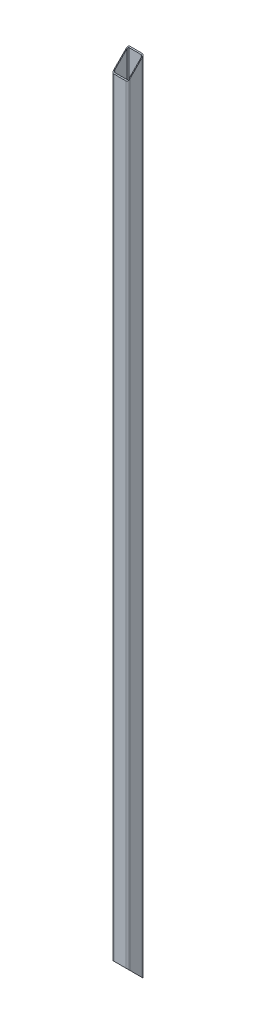
ISO-10303-21;
HEADER;
FILE_DESCRIPTION(('STEP AP214'),'2;1');
FILE_NAME('part.step','',(''),(''),'','','');
FILE_SCHEMA(('AUTOMOTIVE_DESIGN { 1 0 10303 214 1 1 1 1 }'));
ENDSEC;
DATA;
#1=APPLICATION_CONTEXT('core data for automotive mechanical design processes');
#2=APPLICATION_PROTOCOL_DEFINITION('international standard','automotive_design',2000,#1);
#3=PRODUCT_CONTEXT('',#1,'mechanical');
#4=PRODUCT('Part','Part','',(#3));
#5=PRODUCT_RELATED_PRODUCT_CATEGORY('part','',(#4));
#6=PRODUCT_DEFINITION_FORMATION('','',#4);
#7=PRODUCT_DEFINITION_CONTEXT('part definition',#1,'design');
#8=PRODUCT_DEFINITION('design','',#6,#7);
#9=PRODUCT_DEFINITION_SHAPE('','',#8);
#10=(LENGTH_UNIT() NAMED_UNIT(*) SI_UNIT(.MILLI.,.METRE.));
#11=(NAMED_UNIT(*) PLANE_ANGLE_UNIT() SI_UNIT($,.RADIAN.));
#12=(NAMED_UNIT(*) SI_UNIT($,.STERADIAN.) SOLID_ANGLE_UNIT());
#13=UNCERTAINTY_MEASURE_WITH_UNIT(LENGTH_MEASURE(1.E-05),#10,'distance_accuracy_value','');
#14=(GEOMETRIC_REPRESENTATION_CONTEXT(3) GLOBAL_UNCERTAINTY_ASSIGNED_CONTEXT((#13)) GLOBAL_UNIT_ASSIGNED_CONTEXT((#10,
#11,#12)) REPRESENTATION_CONTEXT('',''));
#15=CARTESIAN_POINT('',(0.,0.,0.));
#16=DIRECTION('',(0.,0.,1.));
#17=DIRECTION('',(1.,0.,0.));
#18=AXIS2_PLACEMENT_3D('',#15,#16,#17);
#19=CARTESIAN_POINT('',(-15.5,1960.,-3220.));
#20=DIRECTION('',(0.,0.,-1.));
#21=DIRECTION('',(-1.,0.,0.));
#22=AXIS2_PLACEMENT_3D('',#19,#20,#21);
#23=PLANE('',#22);
#24=DIRECTION('',(0.,-1.,0.));
#25=VECTOR('',#24,1.);
#26=CARTESIAN_POINT('',(-15.5,1960.,-3220.));
#27=LINE('',#26,#25);
#28=CARTESIAN_POINT('',(-15.5,1940.,-3220.));
#29=VERTEX_POINT('',#28);
#30=CARTESIAN_POINT('',(-15.5,20.0000000000002,-3220.));
#31=VERTEX_POINT('',#30);
#32=EDGE_CURVE('E209',#29,#31,#27,.T.);
#33=ORIENTED_EDGE('',*,*,#32,.T.);
#34=DIRECTION('',(-1.,0.,0.));
#35=VECTOR('',#34,1.);
#36=CARTESIAN_POINT('',(-15.5,20.0000000000002,-3220.));
#37=LINE('',#36,#35);
#38=CARTESIAN_POINT('',(15.5,20.0000000000002,-3220.));
#39=VERTEX_POINT('',#38);
#40=EDGE_CURVE('E239',#39,#31,#37,.T.);
#41=ORIENTED_EDGE('',*,*,#40,.F.);
#42=DIRECTION('',(0.,-1.,0.));
#43=VECTOR('',#42,1.);
#44=CARTESIAN_POINT('',(15.5,1960.,-3220.));
#45=LINE('',#44,#43);
#46=CARTESIAN_POINT('',(15.5,1940.,-3220.));
#47=VERTEX_POINT('',#46);
#48=EDGE_CURVE('E207',#47,#39,#45,.T.);
#49=ORIENTED_EDGE('',*,*,#48,.F.);
#50=DIRECTION('',(1.,0.,0.));
#51=VECTOR('',#50,1.);
#52=CARTESIAN_POINT('',(-15.5,1940.,-3220.));
#53=LINE('',#52,#51);
#54=EDGE_CURVE('E279',#29,#47,#53,.T.);
#55=ORIENTED_EDGE('',*,*,#54,.F.);
#56=EDGE_LOOP('',(#33,#41,#49,#55));
#57=FACE_BOUND('',#56,.T.);
#58=ADVANCED_FACE('F39',(#57),#23,.F.);
#59=CARTESIAN_POINT('',(0.,0.,-3240.));
#60=DIRECTION('',(0.,-0.707106781186548,0.707106781186547));
#61=DIRECTION('',(0.,-0.707106781186547,-0.707106781186548));
#62=AXIS2_PLACEMENT_3D('',#59,#60,#61);
#63=PLANE('',#62);
#64=DIRECTION('',(0.,-0.707106781186547,-0.707106781186548));
#65=VECTOR('',#64,1.);
#66=CARTESIAN_POINT('',(-18.,972.5,-2267.5));
#67=LINE('',#66,#65);
#68=CARTESIAN_POINT('',(-18.,15.0000000000003,-3225.));
#69=VERTEX_POINT('',#68);
#70=CARTESIAN_POINT('',(-18.,-15.0000000000001,-3255.));
#71=VERTEX_POINT('',#70);
#72=EDGE_CURVE('E152',#69,#71,#67,.T.);
#73=ORIENTED_EDGE('',*,*,#72,.F.);
#74=CARTESIAN_POINT('',(-15.,15.0000000000003,-3225.));
#75=DIRECTION('',(0.,-0.707106781186548,0.707106781186547));
#76=DIRECTION('',(0.,-0.707106781186547,-0.707106781186548));
#77=AXIS2_PLACEMENT_3D('',#74,#75,#76);
#78=ELLIPSE('',#77,4.24264068711928,3.);
#79=CARTESIAN_POINT('',(-15.,17.9999999999998,-3222.));
#80=VERTEX_POINT('',#79);
#81=EDGE_CURVE('E166',#80,#69,#78,.T.);
#82=ORIENTED_EDGE('',*,*,#81,.F.);
#83=DIRECTION('',(-1.,0.,0.));
#84=VECTOR('',#83,1.);
#85=CARTESIAN_POINT('',(-15.,17.9999999999998,-3222.));
#86=LINE('',#85,#84);
#87=CARTESIAN_POINT('',(15.,18.0000000000002,-3222.));
#88=VERTEX_POINT('',#87);
#89=EDGE_CURVE('E225',#88,#80,#86,.T.);
#90=ORIENTED_EDGE('',*,*,#89,.F.);
#91=CARTESIAN_POINT('',(15.,15.0000000000003,-3225.));
#92=DIRECTION('',(0.,-0.707106781186548,0.707106781186547));
#93=DIRECTION('',(0.,-0.707106781186547,-0.707106781186548));
#94=AXIS2_PLACEMENT_3D('',#91,#92,#93);
#95=ELLIPSE('',#94,4.24264068711928,3.);
#96=CARTESIAN_POINT('',(18.,15.0000000000001,-3225.));
#97=VERTEX_POINT('',#96);
#98=EDGE_CURVE('E227',#97,#88,#95,.T.);
#99=ORIENTED_EDGE('',*,*,#98,.F.);
#100=DIRECTION('',(0.,0.707106781186547,0.707106781186548));
#101=VECTOR('',#100,1.);
#102=CARTESIAN_POINT('',(18.,972.5,-2267.5));
#103=LINE('',#102,#101);
#104=CARTESIAN_POINT('',(18.,-15.0000000000001,-3255.));
#105=VERTEX_POINT('',#104);
#106=EDGE_CURVE('E456',#105,#97,#103,.T.);
#107=ORIENTED_EDGE('',*,*,#106,.F.);
#108=CARTESIAN_POINT('',(15.,-15.0000000000001,-3255.));
#109=DIRECTION('',(0.,-0.707106781186548,0.707106781186547));
#110=DIRECTION('',(0.,-0.707106781186547,-0.707106781186548));
#111=AXIS2_PLACEMENT_3D('',#108,#109,#110);
#112=ELLIPSE('',#111,4.24264068711928,3.);
#113=CARTESIAN_POINT('',(15.,-17.9999999999996,-3258.));
#114=VERTEX_POINT('',#113);
#115=EDGE_CURVE('E457',#114,#105,#112,.T.);
#116=ORIENTED_EDGE('',*,*,#115,.F.);
#117=DIRECTION('',(1.,0.,0.));
#118=VECTOR('',#117,1.);
#119=CARTESIAN_POINT('',(-15.,-17.9999999999996,-3258.));
#120=LINE('',#119,#118);
#121=CARTESIAN_POINT('',(-15.,-17.9999999999998,-3258.));
#122=VERTEX_POINT('',#121);
#123=EDGE_CURVE('E62',#122,#114,#120,.T.);
#124=ORIENTED_EDGE('',*,*,#123,.F.);
#125=CARTESIAN_POINT('',(-15.,-15.0000000000001,-3255.));
#126=DIRECTION('',(0.,-0.707106781186548,0.707106781186547));
#127=DIRECTION('',(0.,-0.707106781186547,-0.707106781186548));
#128=AXIS2_PLACEMENT_3D('',#125,#126,#127);
#129=ELLIPSE('',#128,4.24264068711928,3.);
#130=EDGE_CURVE('E11',#71,#122,#129,.T.);
#131=ORIENTED_EDGE('',*,*,#130,.F.);
#132=EDGE_LOOP('',(#73,#82,#90,#99,#107,#116,#124,#131));
#133=FACE_BOUND('',#132,.T.);
#134=CARTESIAN_POINT('',(-15.5,-15.4999999999996,-3255.5));
#135=DIRECTION('',(0.,-0.707106781186548,0.707106781186547));
#136=DIRECTION('',(0.,-0.707106781186547,-0.707106781186548));
#137=AXIS2_PLACEMENT_3D('',#134,#135,#136);
#138=ELLIPSE('',#137,6.36396103067893,4.5);
#139=CARTESIAN_POINT('',(-20.,-15.4999999999996,-3255.5));
#140=VERTEX_POINT('',#139);
#141=CARTESIAN_POINT('',(-15.5,-20.,-3260.));
#142=VERTEX_POINT('',#141);
#143=EDGE_CURVE('E165',#140,#142,#138,.T.);
#144=ORIENTED_EDGE('',*,*,#143,.T.);
#145=DIRECTION('',(1.,0.,0.));
#146=VECTOR('',#145,1.);
#147=CARTESIAN_POINT('',(-15.5,-20.,-3260.));
#148=LINE('',#147,#146);
#149=CARTESIAN_POINT('',(15.5,-20.,-3260.));
#150=VERTEX_POINT('',#149);
#151=EDGE_CURVE('E221',#142,#150,#148,.T.);
#152=ORIENTED_EDGE('',*,*,#151,.T.);
#153=CARTESIAN_POINT('',(15.5,-15.4999999999996,-3255.5));
#154=DIRECTION('',(0.,-0.707106781186548,0.707106781186547));
#155=DIRECTION('',(0.,-0.707106781186547,-0.707106781186548));
#156=AXIS2_PLACEMENT_3D('',#153,#154,#155);
#157=ELLIPSE('',#156,6.36396103067893,4.5);
#158=CARTESIAN_POINT('',(20.,-15.4999999999992,-3255.5));
#159=VERTEX_POINT('',#158);
#160=EDGE_CURVE('E248',#150,#159,#157,.T.);
#161=ORIENTED_EDGE('',*,*,#160,.T.);
#162=DIRECTION('',(0.,0.707106781186547,0.707106781186548));
#163=VECTOR('',#162,1.);
#164=CARTESIAN_POINT('',(20.,972.25,-2267.75));
#165=LINE('',#164,#163);
#166=CARTESIAN_POINT('',(20.,15.4999999999998,-3224.5));
#167=VERTEX_POINT('',#166);
#168=EDGE_CURVE('E245',#159,#167,#165,.T.);
#169=ORIENTED_EDGE('',*,*,#168,.T.);
#170=CARTESIAN_POINT('',(15.5,15.4999999999998,-3224.5));
#171=DIRECTION('',(0.,-0.707106781186548,0.707106781186547));
#172=DIRECTION('',(0.,-0.707106781186547,-0.707106781186548));
#173=AXIS2_PLACEMENT_3D('',#170,#171,#172);
#174=ELLIPSE('',#173,6.36396103067893,4.5);
#175=EDGE_CURVE('E242',#167,#39,#174,.T.);
#176=ORIENTED_EDGE('',*,*,#175,.T.);
#177=ORIENTED_EDGE('',*,*,#40,.T.);
#178=CARTESIAN_POINT('',(-15.5,15.4999999999998,-3224.5));
#179=DIRECTION('',(0.,-0.707106781186548,0.707106781186547));
#180=DIRECTION('',(0.,-0.707106781186547,-0.707106781186548));
#181=AXIS2_PLACEMENT_3D('',#178,#179,#180);
#182=ELLIPSE('',#181,6.36396103067893,4.5);
#183=CARTESIAN_POINT('',(-20.,15.5000000000005,-3224.5));
#184=VERTEX_POINT('',#183);
#185=EDGE_CURVE('E236',#31,#184,#182,.T.);
#186=ORIENTED_EDGE('',*,*,#185,.T.);
#187=DIRECTION('',(0.,-0.707106781186547,-0.707106781186548));
#188=VECTOR('',#187,1.);
#189=CARTESIAN_POINT('',(-20.,972.25,-2267.75));
#190=LINE('',#189,#188);
#191=EDGE_CURVE('E233',#184,#140,#190,.T.);
#192=ORIENTED_EDGE('',*,*,#191,.T.);
#193=EDGE_LOOP('',(#144,#152,#161,#169,#176,#177,#186,#192));
#194=FACE_BOUND('',#193,.T.);
#195=ADVANCED_FACE('F150',(#133,#194),#63,.T.);
#196=CARTESIAN_POINT('',(15.5,1960.,-3255.5));
#197=DIRECTION('',(0.,-1.,0.));
#198=DIRECTION('',(0.,0.,-1.));
#199=AXIS2_PLACEMENT_3D('',#196,#197,#198);
#200=CYLINDRICAL_SURFACE('',#199,4.5);
#201=ORIENTED_EDGE('',*,*,#160,.F.);
#202=DIRECTION('',(0.,-1.,0.));
#203=VECTOR('',#202,1.);
#204=CARTESIAN_POINT('',(15.5,1960.,-3260.));
#205=LINE('',#204,#203);
#206=CARTESIAN_POINT('',(15.5,1980.,-3260.));
#207=VERTEX_POINT('',#206);
#208=EDGE_CURVE('E198',#207,#150,#205,.T.);
#209=ORIENTED_EDGE('',*,*,#208,.F.);
#210=CARTESIAN_POINT('',(15.5,1975.5,-3255.5));
#211=DIRECTION('',(0.,0.707106781186548,0.707106781186547));
#212=DIRECTION('',(0.,-0.707106781186547,0.707106781186548));
#213=AXIS2_PLACEMENT_3D('',#210,#211,#212);
#214=ELLIPSE('',#213,6.36396103067893,4.5);
#215=CARTESIAN_POINT('',(20.,1975.5,-3255.5));
#216=VERTEX_POINT('',#215);
#217=EDGE_CURVE('E270',#216,#207,#214,.T.);
#218=ORIENTED_EDGE('',*,*,#217,.F.);
#219=DIRECTION('',(0.,-1.,0.));
#220=VECTOR('',#219,1.);
#221=CARTESIAN_POINT('',(20.,1960.,-3255.5));
#222=LINE('',#221,#220);
#223=EDGE_CURVE('E201',#216,#159,#222,.T.);
#224=ORIENTED_EDGE('',*,*,#223,.T.);
#225=EDGE_LOOP('',(#201,#209,#218,#224));
#226=FACE_BOUND('',#225,.T.);
#227=ADVANCED_FACE('F307',(#226),#200,.T.);
#228=CARTESIAN_POINT('',(20.,1960.,-3255.5));
#229=DIRECTION('',(-1.,0.,0.));
#230=DIRECTION('',(0.,0.,1.));
#231=AXIS2_PLACEMENT_3D('',#228,#229,#230);
#232=PLANE('',#231);
#233=ORIENTED_EDGE('',*,*,#168,.F.);
#234=ORIENTED_EDGE('',*,*,#223,.F.);
#235=DIRECTION('',(0.,0.707106781186547,-0.707106781186548));
#236=VECTOR('',#235,1.);
#237=CARTESIAN_POINT('',(20.,1967.75,-3247.75));
#238=LINE('',#237,#236);
#239=CARTESIAN_POINT('',(20.,1944.5,-3224.5));
#240=VERTEX_POINT('',#239);
#241=EDGE_CURVE('E273',#240,#216,#238,.T.);
#242=ORIENTED_EDGE('',*,*,#241,.F.);
#243=DIRECTION('',(0.,-1.,0.));
#244=VECTOR('',#243,1.);
#245=CARTESIAN_POINT('',(20.,1960.,-3224.5));
#246=LINE('',#245,#244);
#247=EDGE_CURVE('E204',#240,#167,#246,.T.);
#248=ORIENTED_EDGE('',*,*,#247,.T.);
#249=EDGE_LOOP('',(#233,#234,#242,#248));
#250=FACE_BOUND('',#249,.T.);
#251=ADVANCED_FACE('F304',(#250),#232,.F.);
#252=CARTESIAN_POINT('',(15.5,1960.,-3224.5));
#253=DIRECTION('',(0.,-1.,0.));
#254=DIRECTION('',(0.,0.,-1.));
#255=AXIS2_PLACEMENT_3D('',#252,#253,#254);
#256=CYLINDRICAL_SURFACE('',#255,4.5);
#257=ORIENTED_EDGE('',*,*,#175,.F.);
#258=ORIENTED_EDGE('',*,*,#247,.F.);
#259=CARTESIAN_POINT('',(15.5,1944.5,-3224.5));
#260=DIRECTION('',(0.,0.707106781186548,0.707106781186547));
#261=DIRECTION('',(0.,-0.707106781186547,0.707106781186548));
#262=AXIS2_PLACEMENT_3D('',#259,#260,#261);
#263=ELLIPSE('',#262,6.36396103067893,4.5);
#264=EDGE_CURVE('E276',#47,#240,#263,.T.);
#265=ORIENTED_EDGE('',*,*,#264,.F.);
#266=ORIENTED_EDGE('',*,*,#48,.T.);
#267=EDGE_LOOP('',(#257,#258,#265,#266));
#268=FACE_BOUND('',#267,.T.);
#269=ADVANCED_FACE('F301',(#268),#256,.T.);
#270=CARTESIAN_POINT('',(-15.5,1960.,-3224.5));
#271=DIRECTION('',(0.,-1.,0.));
#272=DIRECTION('',(0.,0.,-1.));
#273=AXIS2_PLACEMENT_3D('',#270,#271,#272);
#274=CYLINDRICAL_SURFACE('',#273,4.5);
#275=ORIENTED_EDGE('',*,*,#185,.F.);
#276=ORIENTED_EDGE('',*,*,#32,.F.);
#277=CARTESIAN_POINT('',(-15.5,1944.5,-3224.5));
#278=DIRECTION('',(0.,0.707106781186548,0.707106781186547));
#279=DIRECTION('',(0.,-0.707106781186547,0.707106781186548));
#280=AXIS2_PLACEMENT_3D('',#277,#278,#279);
#281=ELLIPSE('',#280,6.36396103067893,4.5);
#282=CARTESIAN_POINT('',(-20.,1944.5,-3224.5));
#283=VERTEX_POINT('',#282);
#284=EDGE_CURVE('E282',#283,#29,#281,.T.);
#285=ORIENTED_EDGE('',*,*,#284,.F.);
#286=DIRECTION('',(0.,-1.,0.));
#287=VECTOR('',#286,1.);
#288=CARTESIAN_POINT('',(-20.,1960.,-3224.5));
#289=LINE('',#288,#287);
#290=EDGE_CURVE('E174',#283,#184,#289,.T.);
#291=ORIENTED_EDGE('',*,*,#290,.T.);
#292=EDGE_LOOP('',(#275,#276,#285,#291));
#293=FACE_BOUND('',#292,.T.);
#294=ADVANCED_FACE('F295',(#293),#274,.T.);
#295=CARTESIAN_POINT('',(-20.,1960.,-3255.5));
#296=DIRECTION('',(1.,0.,0.));
#297=DIRECTION('',(0.,0.,-1.));
#298=AXIS2_PLACEMENT_3D('',#295,#296,#297);
#299=PLANE('',#298);
#300=ORIENTED_EDGE('',*,*,#191,.F.);
#301=ORIENTED_EDGE('',*,*,#290,.F.);
#302=DIRECTION('',(0.,-0.707106781186547,0.707106781186548));
#303=VECTOR('',#302,1.);
#304=CARTESIAN_POINT('',(-20.,1967.75,-3247.75));
#305=LINE('',#304,#303);
#306=CARTESIAN_POINT('',(-20.,1975.5,-3255.5));
#307=VERTEX_POINT('',#306);
#308=EDGE_CURVE('E284',#307,#283,#305,.T.);
#309=ORIENTED_EDGE('',*,*,#308,.F.);
#310=DIRECTION('',(0.,-1.,0.));
#311=VECTOR('',#310,1.);
#312=CARTESIAN_POINT('',(-20.,1960.,-3255.5));
#313=LINE('',#312,#311);
#314=EDGE_CURVE('E54',#307,#140,#313,.T.);
#315=ORIENTED_EDGE('',*,*,#314,.T.);
#316=EDGE_LOOP('',(#300,#301,#309,#315));
#317=FACE_BOUND('',#316,.T.);
#318=ADVANCED_FACE('F293',(#317),#299,.F.);
#319=CARTESIAN_POINT('',(-15.5,1960.,-3255.5));
#320=DIRECTION('',(0.,-1.,0.));
#321=DIRECTION('',(0.,0.,-1.));
#322=AXIS2_PLACEMENT_3D('',#319,#320,#321);
#323=CYLINDRICAL_SURFACE('',#322,4.5);
#324=ORIENTED_EDGE('',*,*,#143,.F.);
#325=ORIENTED_EDGE('',*,*,#314,.F.);
#326=CARTESIAN_POINT('',(-15.5,1975.5,-3255.5));
#327=DIRECTION('',(0.,0.707106781186548,0.707106781186547));
#328=DIRECTION('',(0.,-0.707106781186547,0.707106781186548));
#329=AXIS2_PLACEMENT_3D('',#326,#327,#328);
#330=ELLIPSE('',#329,6.36396103067893,4.5);
#331=CARTESIAN_POINT('',(-15.5,1980.,-3260.));
#332=VERTEX_POINT('',#331);
#333=EDGE_CURVE('E177',#332,#307,#330,.T.);
#334=ORIENTED_EDGE('',*,*,#333,.F.);
#335=DIRECTION('',(0.,-1.,0.));
#336=VECTOR('',#335,1.);
#337=CARTESIAN_POINT('',(-15.5,1960.,-3260.));
#338=LINE('',#337,#336);
#339=EDGE_CURVE('E196',#332,#142,#338,.T.);
#340=ORIENTED_EDGE('',*,*,#339,.T.);
#341=EDGE_LOOP('',(#324,#325,#334,#340));
#342=FACE_BOUND('',#341,.T.);
#343=ADVANCED_FACE('F41',(#342),#323,.T.);
#344=CARTESIAN_POINT('',(-15.5,1960.,-3260.));
#345=DIRECTION('',(0.,0.,1.));
#346=DIRECTION('',(1.,0.,0.));
#347=AXIS2_PLACEMENT_3D('',#344,#345,#346);
#348=PLANE('',#347);
#349=ORIENTED_EDGE('',*,*,#151,.F.);
#350=ORIENTED_EDGE('',*,*,#339,.F.);
#351=DIRECTION('',(-1.,0.,0.));
#352=VECTOR('',#351,1.);
#353=CARTESIAN_POINT('',(-15.5,1980.,-3260.));
#354=LINE('',#353,#352);
#355=EDGE_CURVE('E267',#207,#332,#354,.T.);
#356=ORIENTED_EDGE('',*,*,#355,.F.);
#357=ORIENTED_EDGE('',*,*,#208,.T.);
#358=EDGE_LOOP('',(#349,#350,#356,#357));
#359=FACE_BOUND('',#358,.T.);
#360=ADVANCED_FACE('F309',(#359),#348,.F.);
#361=CARTESIAN_POINT('',(-18.,1960.,-3255.));
#362=DIRECTION('',(1.,0.,0.));
#363=DIRECTION('',(0.,0.,-1.));
#364=AXIS2_PLACEMENT_3D('',#361,#362,#363);
#365=PLANE('',#364);
#366=DIRECTION('',(0.,-1.,0.));
#367=VECTOR('',#366,1.);
#368=CARTESIAN_POINT('',(-18.,1960.,-3225.));
#369=LINE('',#368,#367);
#370=CARTESIAN_POINT('',(-18.,1945.,-3225.));
#371=VERTEX_POINT('',#370);
#372=EDGE_CURVE('E163',#371,#69,#369,.T.);
#373=ORIENTED_EDGE('',*,*,#372,.T.);
#374=ORIENTED_EDGE('',*,*,#72,.T.);
#375=DIRECTION('',(0.,-1.,0.));
#376=VECTOR('',#375,1.);
#377=CARTESIAN_POINT('',(-18.,1960.,-3255.));
#378=LINE('',#377,#376);
#379=CARTESIAN_POINT('',(-18.,1975.,-3255.));
#380=VERTEX_POINT('',#379);
#381=EDGE_CURVE('E161',#380,#71,#378,.T.);
#382=ORIENTED_EDGE('',*,*,#381,.F.);
#383=DIRECTION('',(0.,-0.707106781186547,0.707106781186548));
#384=VECTOR('',#383,1.);
#385=CARTESIAN_POINT('',(-18.,1967.5,-3247.5));
#386=LINE('',#385,#384);
#387=EDGE_CURVE('E47',#380,#371,#386,.T.);
#388=ORIENTED_EDGE('',*,*,#387,.T.);
#389=EDGE_LOOP('',(#373,#374,#382,#388));
#390=FACE_BOUND('',#389,.T.);
#391=ADVANCED_FACE('F159',(#390),#365,.T.);
#392=CARTESIAN_POINT('',(-15.,1960.,-3225.));
#393=DIRECTION('',(0.,-1.,0.));
#394=DIRECTION('',(0.,0.,-1.));
#395=AXIS2_PLACEMENT_3D('',#392,#393,#394);
#396=CYLINDRICAL_SURFACE('',#395,3.);
#397=DIRECTION('',(0.,-1.,0.));
#398=VECTOR('',#397,1.);
#399=CARTESIAN_POINT('',(-15.,1960.,-3222.));
#400=LINE('',#399,#398);
#401=CARTESIAN_POINT('',(-15.,1942.,-3222.));
#402=VERTEX_POINT('',#401);
#403=EDGE_CURVE('E172',#402,#80,#400,.T.);
#404=ORIENTED_EDGE('',*,*,#403,.T.);
#405=ORIENTED_EDGE('',*,*,#81,.T.);
#406=ORIENTED_EDGE('',*,*,#372,.F.);
#407=CARTESIAN_POINT('',(-15.,1945.,-3225.));
#408=DIRECTION('',(0.,0.707106781186548,0.707106781186547));
#409=DIRECTION('',(0.,-0.707106781186547,0.707106781186548));
#410=AXIS2_PLACEMENT_3D('',#407,#408,#409);
#411=ELLIPSE('',#410,4.24264068711928,3.);
#412=EDGE_CURVE('E216',#371,#402,#411,.T.);
#413=ORIENTED_EDGE('',*,*,#412,.T.);
#414=EDGE_LOOP('',(#404,#405,#406,#413));
#415=FACE_BOUND('',#414,.T.);
#416=ADVANCED_FACE('F223',(#415),#396,.F.);
#417=CARTESIAN_POINT('',(-15.,1960.,-3222.));
#418=DIRECTION('',(0.,0.,-1.));
#419=DIRECTION('',(-1.,0.,0.));
#420=AXIS2_PLACEMENT_3D('',#417,#418,#419);
#421=PLANE('',#420);
#422=DIRECTION('',(0.,-1.,0.));
#423=VECTOR('',#422,1.);
#424=CARTESIAN_POINT('',(15.,1960.,-3222.));
#425=LINE('',#424,#423);
#426=CARTESIAN_POINT('',(15.,1942.,-3222.));
#427=VERTEX_POINT('',#426);
#428=EDGE_CURVE('E182',#427,#88,#425,.T.);
#429=ORIENTED_EDGE('',*,*,#428,.T.);
#430=ORIENTED_EDGE('',*,*,#89,.T.);
#431=ORIENTED_EDGE('',*,*,#403,.F.);
#432=DIRECTION('',(1.,0.,0.));
#433=VECTOR('',#432,1.);
#434=CARTESIAN_POINT('',(-15.,1942.,-3222.));
#435=LINE('',#434,#433);
#436=EDGE_CURVE('E218',#402,#427,#435,.T.);
#437=ORIENTED_EDGE('',*,*,#436,.T.);
#438=EDGE_LOOP('',(#429,#430,#431,#437));
#439=FACE_BOUND('',#438,.T.);
#440=ADVANCED_FACE('F420',(#439),#421,.T.);
#441=CARTESIAN_POINT('',(15.,1960.,-3225.));
#442=DIRECTION('',(0.,-1.,0.));
#443=DIRECTION('',(0.,0.,-1.));
#444=AXIS2_PLACEMENT_3D('',#441,#442,#443);
#445=CYLINDRICAL_SURFACE('',#444,3.);
#446=DIRECTION('',(0.,-1.,0.));
#447=VECTOR('',#446,1.);
#448=CARTESIAN_POINT('',(18.,1960.,-3225.));
#449=LINE('',#448,#447);
#450=CARTESIAN_POINT('',(18.,1945.,-3225.));
#451=VERTEX_POINT('',#450);
#452=EDGE_CURVE('E185',#451,#97,#449,.T.);
#453=ORIENTED_EDGE('',*,*,#452,.T.);
#454=ORIENTED_EDGE('',*,*,#98,.T.);
#455=ORIENTED_EDGE('',*,*,#428,.F.);
#456=CARTESIAN_POINT('',(15.,1945.,-3225.));
#457=DIRECTION('',(0.,0.707106781186548,0.707106781186547));
#458=DIRECTION('',(0.,-0.707106781186547,0.707106781186548));
#459=AXIS2_PLACEMENT_3D('',#456,#457,#458);
#460=ELLIPSE('',#459,4.24264068711928,3.);
#461=EDGE_CURVE('E254',#427,#451,#460,.T.);
#462=ORIENTED_EDGE('',*,*,#461,.T.);
#463=EDGE_LOOP('',(#453,#454,#455,#462));
#464=FACE_BOUND('',#463,.T.);
#465=ADVANCED_FACE('F412',(#464),#445,.F.);
#466=CARTESIAN_POINT('',(18.,1960.,-3255.));
#467=DIRECTION('',(-1.,0.,0.));
#468=DIRECTION('',(0.,0.,1.));
#469=AXIS2_PLACEMENT_3D('',#466,#467,#468);
#470=PLANE('',#469);
#471=DIRECTION('',(0.,-1.,0.));
#472=VECTOR('',#471,1.);
#473=CARTESIAN_POINT('',(18.,1960.,-3255.));
#474=LINE('',#473,#472);
#475=CARTESIAN_POINT('',(18.,1975.,-3255.));
#476=VERTEX_POINT('',#475);
#477=EDGE_CURVE('E188',#476,#105,#474,.T.);
#478=ORIENTED_EDGE('',*,*,#477,.T.);
#479=ORIENTED_EDGE('',*,*,#106,.T.);
#480=ORIENTED_EDGE('',*,*,#452,.F.);
#481=DIRECTION('',(0.,0.707106781186547,-0.707106781186548));
#482=VECTOR('',#481,1.);
#483=CARTESIAN_POINT('',(18.,1967.5,-3247.5));
#484=LINE('',#483,#482);
#485=EDGE_CURVE('E257',#451,#476,#484,.T.);
#486=ORIENTED_EDGE('',*,*,#485,.T.);
#487=EDGE_LOOP('',(#478,#479,#480,#486));
#488=FACE_BOUND('',#487,.T.);
#489=ADVANCED_FACE('F404',(#488),#470,.T.);
#490=CARTESIAN_POINT('',(15.,1960.,-3255.));
#491=DIRECTION('',(0.,-1.,0.));
#492=DIRECTION('',(0.,0.,-1.));
#493=AXIS2_PLACEMENT_3D('',#490,#491,#492);
#494=CYLINDRICAL_SURFACE('',#493,3.);
#495=DIRECTION('',(0.,-1.,0.));
#496=VECTOR('',#495,1.);
#497=CARTESIAN_POINT('',(15.,1960.,-3258.));
#498=LINE('',#497,#496);
#499=CARTESIAN_POINT('',(15.,1978.,-3258.));
#500=VERTEX_POINT('',#499);
#501=EDGE_CURVE('E191',#500,#114,#498,.T.);
#502=ORIENTED_EDGE('',*,*,#501,.T.);
#503=ORIENTED_EDGE('',*,*,#115,.T.);
#504=ORIENTED_EDGE('',*,*,#477,.F.);
#505=CARTESIAN_POINT('',(15.,1975.,-3255.));
#506=DIRECTION('',(0.,0.707106781186548,0.707106781186547));
#507=DIRECTION('',(0.,-0.707106781186547,0.707106781186548));
#508=AXIS2_PLACEMENT_3D('',#505,#506,#507);
#509=ELLIPSE('',#508,4.24264068711928,3.);
#510=EDGE_CURVE('E260',#476,#500,#509,.T.);
#511=ORIENTED_EDGE('',*,*,#510,.T.);
#512=EDGE_LOOP('',(#502,#503,#504,#511));
#513=FACE_BOUND('',#512,.T.);
#514=ADVANCED_FACE('F396',(#513),#494,.F.);
#515=CARTESIAN_POINT('',(-15.,1960.,-3258.));
#516=DIRECTION('',(0.,0.,1.));
#517=DIRECTION('',(1.,0.,0.));
#518=AXIS2_PLACEMENT_3D('',#515,#516,#517);
#519=PLANE('',#518);
#520=DIRECTION('',(0.,-1.,0.));
#521=VECTOR('',#520,1.);
#522=CARTESIAN_POINT('',(-15.,1960.,-3258.));
#523=LINE('',#522,#521);
#524=CARTESIAN_POINT('',(-15.,1978.,-3258.));
#525=VERTEX_POINT('',#524);
#526=EDGE_CURVE('E194',#525,#122,#523,.T.);
#527=ORIENTED_EDGE('',*,*,#526,.T.);
#528=ORIENTED_EDGE('',*,*,#123,.T.);
#529=ORIENTED_EDGE('',*,*,#501,.F.);
#530=DIRECTION('',(-1.,0.,0.));
#531=VECTOR('',#530,1.);
#532=CARTESIAN_POINT('',(-15.,1978.,-3258.));
#533=LINE('',#532,#531);
#534=EDGE_CURVE('E263',#500,#525,#533,.T.);
#535=ORIENTED_EDGE('',*,*,#534,.T.);
#536=EDGE_LOOP('',(#527,#528,#529,#535));
#537=FACE_BOUND('',#536,.T.);
#538=ADVANCED_FACE('F390',(#537),#519,.T.);
#539=CARTESIAN_POINT('',(-15.,1960.,-3255.));
#540=DIRECTION('',(0.,-1.,0.));
#541=DIRECTION('',(0.,0.,-1.));
#542=AXIS2_PLACEMENT_3D('',#539,#540,#541);
#543=CYLINDRICAL_SURFACE('',#542,3.);
#544=ORIENTED_EDGE('',*,*,#381,.T.);
#545=ORIENTED_EDGE('',*,*,#130,.T.);
#546=ORIENTED_EDGE('',*,*,#526,.F.);
#547=CARTESIAN_POINT('',(-15.,1975.,-3255.));
#548=DIRECTION('',(0.,0.707106781186548,0.707106781186547));
#549=DIRECTION('',(0.,-0.707106781186547,0.707106781186548));
#550=AXIS2_PLACEMENT_3D('',#547,#548,#549);
#551=ELLIPSE('',#550,4.24264068711928,3.);
#552=EDGE_CURVE('E170',#525,#380,#551,.T.);
#553=ORIENTED_EDGE('',*,*,#552,.T.);
#554=EDGE_LOOP('',(#544,#545,#546,#553));
#555=FACE_BOUND('',#554,.T.);
#556=ADVANCED_FACE('F169',(#555),#543,.F.);
#557=CARTESIAN_POINT('',(0.,1960.,-3240.));
#558=DIRECTION('',(0.,0.707106781186548,0.707106781186547));
#559=DIRECTION('',(0.,-0.707106781186547,0.707106781186548));
#560=AXIS2_PLACEMENT_3D('',#557,#558,#559);
#561=PLANE('',#560);
#562=ORIENTED_EDGE('',*,*,#552,.F.);
#563=ORIENTED_EDGE('',*,*,#534,.F.);
#564=ORIENTED_EDGE('',*,*,#510,.F.);
#565=ORIENTED_EDGE('',*,*,#485,.F.);
#566=ORIENTED_EDGE('',*,*,#461,.F.);
#567=ORIENTED_EDGE('',*,*,#436,.F.);
#568=ORIENTED_EDGE('',*,*,#412,.F.);
#569=ORIENTED_EDGE('',*,*,#387,.F.);
#570=EDGE_LOOP('',(#562,#563,#564,#565,#566,#567,#568,#569));
#571=FACE_BOUND('',#570,.T.);
#572=ORIENTED_EDGE('',*,*,#355,.T.);
#573=ORIENTED_EDGE('',*,*,#333,.T.);
#574=ORIENTED_EDGE('',*,*,#308,.T.);
#575=ORIENTED_EDGE('',*,*,#284,.T.);
#576=ORIENTED_EDGE('',*,*,#54,.T.);
#577=ORIENTED_EDGE('',*,*,#264,.T.);
#578=ORIENTED_EDGE('',*,*,#241,.T.);
#579=ORIENTED_EDGE('',*,*,#217,.T.);
#580=EDGE_LOOP('',(#572,#573,#574,#575,#576,#577,#578,#579));
#581=FACE_BOUND('',#580,.T.);
#582=ADVANCED_FACE('F213',(#571,#581),#561,.T.);
#583=CLOSED_SHELL('',(#58,#195,#227,#251,#269,#294,#318,#343,#360,#391,#416,#440,#465,#489,#514,
#538,#556,#582));
#584=MANIFOLD_SOLID_BREP('B2',#583);
#585=ADVANCED_BREP_SHAPE_REPRESENTATION('',(#18,#584),#14);
#586=SHAPE_DEFINITION_REPRESENTATION(#9,#585);
ENDSEC;
END-ISO-10303-21;
